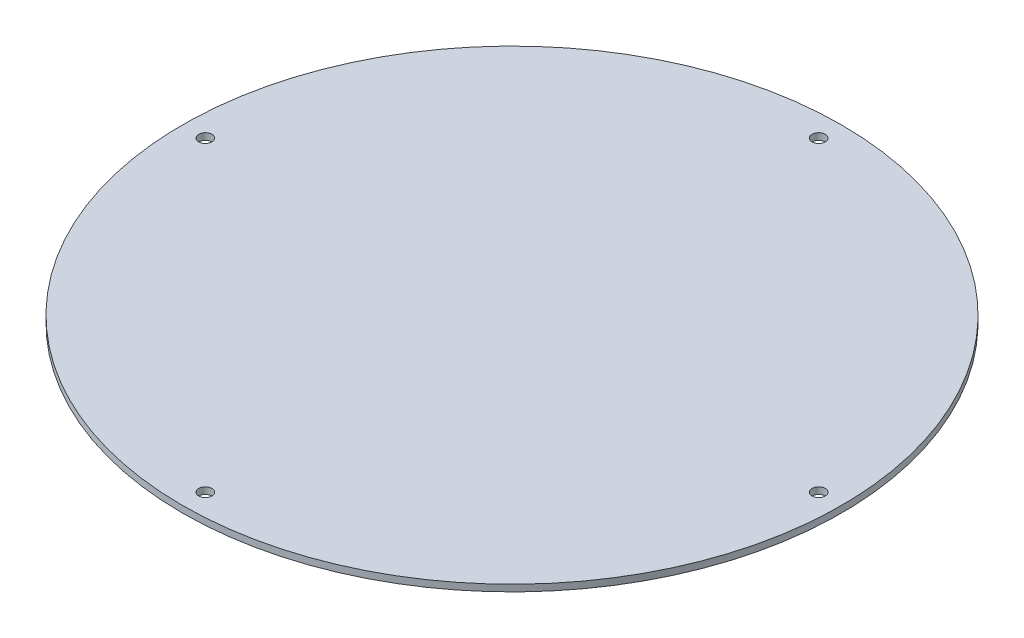
ISO-10303-21;
HEADER;
FILE_DESCRIPTION(('STEP AP214'),'2;1');
FILE_NAME('part.step','',(''),(''),'','','');
FILE_SCHEMA(('AUTOMOTIVE_DESIGN { 1 0 10303 214 1 1 1 1 }'));
ENDSEC;
DATA;
#1=APPLICATION_CONTEXT('core data for automotive mechanical design processes');
#2=APPLICATION_PROTOCOL_DEFINITION('international standard','automotive_design',2000,#1);
#3=PRODUCT_CONTEXT('',#1,'mechanical');
#4=PRODUCT('Part','Part','',(#3));
#5=PRODUCT_RELATED_PRODUCT_CATEGORY('part','',(#4));
#6=PRODUCT_DEFINITION_FORMATION('','',#4);
#7=PRODUCT_DEFINITION_CONTEXT('part definition',#1,'design');
#8=PRODUCT_DEFINITION('design','',#6,#7);
#9=PRODUCT_DEFINITION_SHAPE('','',#8);
#10=(LENGTH_UNIT() NAMED_UNIT(*) SI_UNIT(.MILLI.,.METRE.));
#11=(NAMED_UNIT(*) PLANE_ANGLE_UNIT() SI_UNIT($,.RADIAN.));
#12=(NAMED_UNIT(*) SI_UNIT($,.STERADIAN.) SOLID_ANGLE_UNIT());
#13=UNCERTAINTY_MEASURE_WITH_UNIT(LENGTH_MEASURE(1.E-05),#10,'distance_accuracy_value','');
#14=(GEOMETRIC_REPRESENTATION_CONTEXT(3) GLOBAL_UNCERTAINTY_ASSIGNED_CONTEXT((#13)) GLOBAL_UNIT_ASSIGNED_CONTEXT((#10,
#11,#12)) REPRESENTATION_CONTEXT('',''));
#15=CARTESIAN_POINT('',(0.,0.,0.));
#16=DIRECTION('',(0.,0.,1.));
#17=DIRECTION('',(1.,0.,0.));
#18=AXIS2_PLACEMENT_3D('',#15,#16,#17);
#19=CARTESIAN_POINT('',(0.,1.64,0.));
#20=DIRECTION('',(0.,-1.,0.));
#21=DIRECTION('',(0.,0.,-1.));
#22=AXIS2_PLACEMENT_3D('',#19,#20,#21);
#23=CYLINDRICAL_SURFACE('',#22,81.);
#24=CARTESIAN_POINT('',(0.,1.64,0.));
#25=DIRECTION('',(0.,1.,0.));
#26=DIRECTION('',(0.,0.,1.));
#27=AXIS2_PLACEMENT_3D('',#24,#25,#26);
#28=CIRCLE('',#27,81.);
#29=CARTESIAN_POINT('',(0.,1.64,81.));
#30=VERTEX_POINT('',#29);
#31=EDGE_CURVE('E10',#30,#30,#28,.T.);
#32=ORIENTED_EDGE('',*,*,#31,.F.);
#33=EDGE_LOOP('',(#32));
#34=FACE_BOUND('',#33,.T.);
#35=CARTESIAN_POINT('',(0.,0.,0.));
#36=DIRECTION('',(0.,1.,0.));
#37=DIRECTION('',(0.,0.,1.));
#38=AXIS2_PLACEMENT_3D('',#35,#36,#37);
#39=CIRCLE('',#38,81.);
#40=CARTESIAN_POINT('',(0.,0.,81.));
#41=VERTEX_POINT('',#40);
#42=EDGE_CURVE('E40',#41,#41,#39,.T.);
#43=ORIENTED_EDGE('',*,*,#42,.T.);
#44=EDGE_LOOP('',(#43));
#45=FACE_BOUND('',#44,.T.);
#46=ADVANCED_FACE('F37',(#34,#45),#23,.T.);
#47=CARTESIAN_POINT('',(0.,1.64,0.));
#48=DIRECTION('',(0.,1.,0.));
#49=DIRECTION('',(0.,0.,1.));
#50=AXIS2_PLACEMENT_3D('',#47,#48,#49);
#51=PLANE('',#50);
#52=CARTESIAN_POINT('',(-75.375,1.64,0.));
#53=DIRECTION('',(0.,1.,0.));
#54=DIRECTION('',(0.,0.,1.));
#55=AXIS2_PLACEMENT_3D('',#52,#53,#54);
#56=CIRCLE('',#55,1.625);
#57=CARTESIAN_POINT('',(-75.375,1.64,1.625));
#58=VERTEX_POINT('',#57);
#59=EDGE_CURVE('E75',#58,#58,#56,.T.);
#60=ORIENTED_EDGE('',*,*,#59,.F.);
#61=EDGE_LOOP('',(#60));
#62=FACE_BOUND('',#61,.T.);
#63=CARTESIAN_POINT('',(0.,1.64,75.375));
#64=DIRECTION('',(0.,1.,0.));
#65=DIRECTION('',(0.,0.,1.));
#66=AXIS2_PLACEMENT_3D('',#63,#64,#65);
#67=CIRCLE('',#66,1.625);
#68=CARTESIAN_POINT('',(0.,1.64,77.));
#69=VERTEX_POINT('',#68);
#70=EDGE_CURVE('E67',#69,#69,#67,.T.);
#71=ORIENTED_EDGE('',*,*,#70,.F.);
#72=EDGE_LOOP('',(#71));
#73=FACE_BOUND('',#72,.T.);
#74=CARTESIAN_POINT('',(75.375,1.64,0.));
#75=DIRECTION('',(0.,1.,0.));
#76=DIRECTION('',(0.,0.,1.));
#77=AXIS2_PLACEMENT_3D('',#74,#75,#76);
#78=CIRCLE('',#77,1.625);
#79=CARTESIAN_POINT('',(75.375,1.64,1.625));
#80=VERTEX_POINT('',#79);
#81=EDGE_CURVE('E59',#80,#80,#78,.T.);
#82=ORIENTED_EDGE('',*,*,#81,.F.);
#83=EDGE_LOOP('',(#82));
#84=FACE_BOUND('',#83,.T.);
#85=CARTESIAN_POINT('',(0.,1.64,-75.375));
#86=DIRECTION('',(0.,1.,0.));
#87=DIRECTION('',(0.,0.,1.));
#88=AXIS2_PLACEMENT_3D('',#85,#86,#87);
#89=CIRCLE('',#88,1.625);
#90=CARTESIAN_POINT('',(0.,1.64,-73.75));
#91=VERTEX_POINT('',#90);
#92=EDGE_CURVE('E51',#91,#91,#89,.T.);
#93=ORIENTED_EDGE('',*,*,#92,.F.);
#94=EDGE_LOOP('',(#93));
#95=FACE_BOUND('',#94,.T.);
#96=ORIENTED_EDGE('',*,*,#31,.T.);
#97=EDGE_LOOP('',(#96));
#98=FACE_BOUND('',#97,.T.);
#99=ADVANCED_FACE('F93',(#62,#73,#84,#95,#98),#51,.T.);
#100=CARTESIAN_POINT('',(0.,0.,0.));
#101=DIRECTION('',(0.,1.,0.));
#102=DIRECTION('',(0.,0.,1.));
#103=AXIS2_PLACEMENT_3D('',#100,#101,#102);
#104=PLANE('',#103);
#105=CARTESIAN_POINT('',(-75.375,0.,0.));
#106=DIRECTION('',(0.,1.,0.));
#107=DIRECTION('',(0.,0.,1.));
#108=AXIS2_PLACEMENT_3D('',#105,#106,#107);
#109=CIRCLE('',#108,1.625);
#110=CARTESIAN_POINT('',(-75.375,0.,1.625));
#111=VERTEX_POINT('',#110);
#112=EDGE_CURVE('E49',#111,#111,#109,.T.);
#113=ORIENTED_EDGE('',*,*,#112,.T.);
#114=EDGE_LOOP('',(#113));
#115=FACE_BOUND('',#114,.T.);
#116=CARTESIAN_POINT('',(0.,0.,75.375));
#117=DIRECTION('',(0.,1.,0.));
#118=DIRECTION('',(0.,0.,1.));
#119=AXIS2_PLACEMENT_3D('',#116,#117,#118);
#120=CIRCLE('',#119,1.625);
#121=CARTESIAN_POINT('',(0.,0.,77.));
#122=VERTEX_POINT('',#121);
#123=EDGE_CURVE('E71',#122,#122,#120,.T.);
#124=ORIENTED_EDGE('',*,*,#123,.T.);
#125=EDGE_LOOP('',(#124));
#126=FACE_BOUND('',#125,.T.);
#127=CARTESIAN_POINT('',(75.375,0.,0.));
#128=DIRECTION('',(0.,1.,0.));
#129=DIRECTION('',(0.,0.,1.));
#130=AXIS2_PLACEMENT_3D('',#127,#128,#129);
#131=CIRCLE('',#130,1.625);
#132=CARTESIAN_POINT('',(75.375,0.,1.625));
#133=VERTEX_POINT('',#132);
#134=EDGE_CURVE('E63',#133,#133,#131,.T.);
#135=ORIENTED_EDGE('',*,*,#134,.T.);
#136=EDGE_LOOP('',(#135));
#137=FACE_BOUND('',#136,.T.);
#138=CARTESIAN_POINT('',(0.,0.,-75.375));
#139=DIRECTION('',(0.,1.,0.));
#140=DIRECTION('',(0.,0.,1.));
#141=AXIS2_PLACEMENT_3D('',#138,#139,#140);
#142=CIRCLE('',#141,1.625);
#143=CARTESIAN_POINT('',(0.,0.,-73.75));
#144=VERTEX_POINT('',#143);
#145=EDGE_CURVE('E55',#144,#144,#142,.T.);
#146=ORIENTED_EDGE('',*,*,#145,.T.);
#147=EDGE_LOOP('',(#146));
#148=FACE_BOUND('',#147,.T.);
#149=ORIENTED_EDGE('',*,*,#42,.F.);
#150=EDGE_LOOP('',(#149));
#151=FACE_BOUND('',#150,.T.);
#152=ADVANCED_FACE('F83',(#115,#126,#137,#148,#151),#104,.F.);
#153=CARTESIAN_POINT('',(0.,0.,-75.375));
#154=DIRECTION('',(0.,1.,0.));
#155=DIRECTION('',(0.,0.,1.));
#156=AXIS2_PLACEMENT_3D('',#153,#154,#155);
#157=CYLINDRICAL_SURFACE('',#156,1.625);
#158=ORIENTED_EDGE('',*,*,#145,.F.);
#159=EDGE_LOOP('',(#158));
#160=FACE_BOUND('',#159,.T.);
#161=ORIENTED_EDGE('',*,*,#92,.T.);
#162=EDGE_LOOP('',(#161));
#163=FACE_BOUND('',#162,.T.);
#164=ADVANCED_FACE('F103',(#160,#163),#157,.F.);
#165=CARTESIAN_POINT('',(75.375,0.,0.));
#166=DIRECTION('',(0.,1.,0.));
#167=DIRECTION('',(0.,0.,1.));
#168=AXIS2_PLACEMENT_3D('',#165,#166,#167);
#169=CYLINDRICAL_SURFACE('',#168,1.625);
#170=ORIENTED_EDGE('',*,*,#134,.F.);
#171=EDGE_LOOP('',(#170));
#172=FACE_BOUND('',#171,.T.);
#173=ORIENTED_EDGE('',*,*,#81,.T.);
#174=EDGE_LOOP('',(#173));
#175=FACE_BOUND('',#174,.T.);
#176=ADVANCED_FACE('F105',(#172,#175),#169,.F.);
#177=CARTESIAN_POINT('',(0.,0.,75.375));
#178=DIRECTION('',(0.,1.,0.));
#179=DIRECTION('',(0.,0.,1.));
#180=AXIS2_PLACEMENT_3D('',#177,#178,#179);
#181=CYLINDRICAL_SURFACE('',#180,1.625);
#182=ORIENTED_EDGE('',*,*,#123,.F.);
#183=EDGE_LOOP('',(#182));
#184=FACE_BOUND('',#183,.T.);
#185=ORIENTED_EDGE('',*,*,#70,.T.);
#186=EDGE_LOOP('',(#185));
#187=FACE_BOUND('',#186,.T.);
#188=ADVANCED_FACE('F89',(#184,#187),#181,.F.);
#189=CARTESIAN_POINT('',(-75.375,0.,0.));
#190=DIRECTION('',(0.,1.,0.));
#191=DIRECTION('',(0.,0.,1.));
#192=AXIS2_PLACEMENT_3D('',#189,#190,#191);
#193=CYLINDRICAL_SURFACE('',#192,1.625);
#194=ORIENTED_EDGE('',*,*,#112,.F.);
#195=EDGE_LOOP('',(#194));
#196=FACE_BOUND('',#195,.T.);
#197=ORIENTED_EDGE('',*,*,#59,.T.);
#198=EDGE_LOOP('',(#197));
#199=FACE_BOUND('',#198,.T.);
#200=ADVANCED_FACE('F86',(#196,#199),#193,.F.);
#201=CLOSED_SHELL('',(#46,#99,#152,#164,#176,#188,#200));
#202=MANIFOLD_SOLID_BREP('B2',#201);
#203=ADVANCED_BREP_SHAPE_REPRESENTATION('',(#18,#202),#14);
#204=SHAPE_DEFINITION_REPRESENTATION(#9,#203);
ENDSEC;
END-ISO-10303-21;
